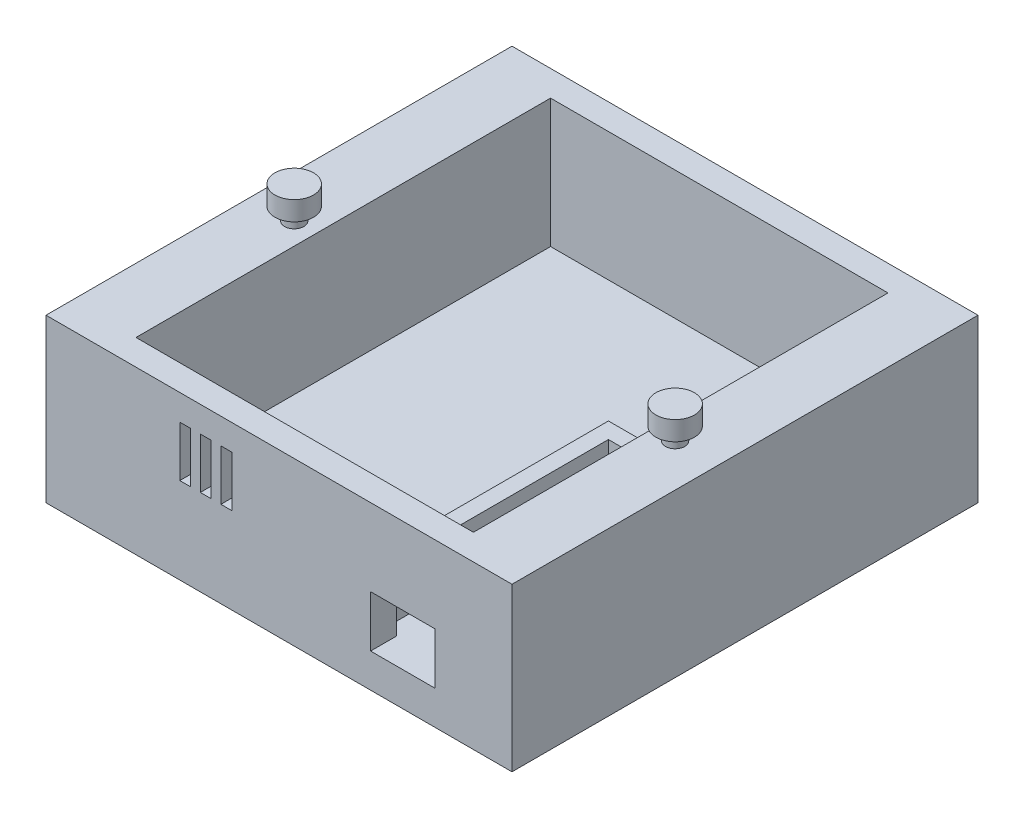
ISO-10303-21;
HEADER;
FILE_DESCRIPTION(('STEP AP214'),'2;1');
FILE_NAME('part.step','',(''),(''),'','','');
FILE_SCHEMA(('AUTOMOTIVE_DESIGN { 1 0 10303 214 1 1 1 1 }'));
ENDSEC;
DATA;
#1=APPLICATION_CONTEXT('core data for automotive mechanical design processes');
#2=APPLICATION_PROTOCOL_DEFINITION('international standard','automotive_design',2000,#1);
#3=PRODUCT_CONTEXT('',#1,'mechanical');
#4=PRODUCT('Part','Part','',(#3));
#5=PRODUCT_RELATED_PRODUCT_CATEGORY('part','',(#4));
#6=PRODUCT_DEFINITION_FORMATION('','',#4);
#7=PRODUCT_DEFINITION_CONTEXT('part definition',#1,'design');
#8=PRODUCT_DEFINITION('design','',#6,#7);
#9=PRODUCT_DEFINITION_SHAPE('','',#8);
#10=(LENGTH_UNIT() NAMED_UNIT(*) SI_UNIT(.MILLI.,.METRE.));
#11=(NAMED_UNIT(*) PLANE_ANGLE_UNIT() SI_UNIT($,.RADIAN.));
#12=(NAMED_UNIT(*) SI_UNIT($,.STERADIAN.) SOLID_ANGLE_UNIT());
#13=UNCERTAINTY_MEASURE_WITH_UNIT(LENGTH_MEASURE(1.E-05),#10,'distance_accuracy_value','');
#14=(GEOMETRIC_REPRESENTATION_CONTEXT(3) GLOBAL_UNCERTAINTY_ASSIGNED_CONTEXT((#13)) GLOBAL_UNIT_ASSIGNED_CONTEXT((#10,
#11,#12)) REPRESENTATION_CONTEXT('',''));
#15=CARTESIAN_POINT('',(0.,0.,0.));
#16=DIRECTION('',(0.,0.,1.));
#17=DIRECTION('',(1.,0.,0.));
#18=AXIS2_PLACEMENT_3D('',#15,#16,#17);
#19=CARTESIAN_POINT('',(79.375,6.7,-5.08));
#20=DIRECTION('',(1.,0.,0.));
#21=DIRECTION('',(0.,0.,-1.));
#22=AXIS2_PLACEMENT_3D('',#19,#20,#21);
#23=PLANE('',#22);
#24=DIRECTION('',(0.,-1.,0.));
#25=VECTOR('',#24,1.);
#26=CARTESIAN_POINT('',(79.375,16.86,-52.705));
#27=LINE('',#26,#25);
#28=CARTESIAN_POINT('',(79.375,16.86,-52.705));
#29=VERTEX_POINT('',#28);
#30=CARTESIAN_POINT('',(79.375,6.7,-52.705));
#31=VERTEX_POINT('',#30);
#32=EDGE_CURVE('E290',#29,#31,#27,.T.);
#33=ORIENTED_EDGE('',*,*,#32,.F.);
#34=DIRECTION('',(0.,0.,-1.));
#35=VECTOR('',#34,1.);
#36=CARTESIAN_POINT('',(79.375,16.86,0.));
#37=LINE('',#36,#35);
#38=CARTESIAN_POINT('',(79.375,16.86,-49.53));
#39=VERTEX_POINT('',#38);
#40=EDGE_CURVE('E288',#39,#29,#37,.T.);
#41=ORIENTED_EDGE('',*,*,#40,.F.);
#42=DIRECTION('',(0.,-1.,0.));
#43=VECTOR('',#42,1.);
#44=CARTESIAN_POINT('',(79.375,16.86,-49.53));
#45=LINE('',#44,#43);
#46=CARTESIAN_POINT('',(79.375,6.7,-49.53));
#47=VERTEX_POINT('',#46);
#48=EDGE_CURVE('E301',#39,#47,#45,.T.);
#49=ORIENTED_EDGE('',*,*,#48,.T.);
#50=DIRECTION('',(0.,0.,-1.));
#51=VECTOR('',#50,1.);
#52=CARTESIAN_POINT('',(79.375,6.7,-5.08));
#53=LINE('',#52,#51);
#54=CARTESIAN_POINT('',(79.375,6.7,-5.08));
#55=VERTEX_POINT('',#54);
#56=EDGE_CURVE('E391',#55,#47,#53,.T.);
#57=ORIENTED_EDGE('',*,*,#56,.F.);
#58=DIRECTION('',(0.,1.,0.));
#59=VECTOR('',#58,1.);
#60=CARTESIAN_POINT('',(79.375,6.7,-5.08));
#61=LINE('',#60,#59);
#62=CARTESIAN_POINT('',(79.375,32.1,-5.08));
#63=VERTEX_POINT('',#62);
#64=EDGE_CURVE('E412',#55,#63,#61,.T.);
#65=ORIENTED_EDGE('',*,*,#64,.T.);
#66=DIRECTION('',(0.,0.,-1.));
#67=VECTOR('',#66,1.);
#68=CARTESIAN_POINT('',(79.375,32.1,-5.08));
#69=LINE('',#68,#67);
#70=CARTESIAN_POINT('',(79.375,32.1,-86.995));
#71=VERTEX_POINT('',#70);
#72=EDGE_CURVE('E402',#63,#71,#69,.T.);
#73=ORIENTED_EDGE('',*,*,#72,.T.);
#74=DIRECTION('',(0.,1.,0.));
#75=VECTOR('',#74,1.);
#76=CARTESIAN_POINT('',(79.375,6.7,-86.995));
#77=LINE('',#76,#75);
#78=CARTESIAN_POINT('',(79.375,6.7,-86.995));
#79=VERTEX_POINT('',#78);
#80=EDGE_CURVE('E410',#79,#71,#77,.T.);
#81=ORIENTED_EDGE('',*,*,#80,.F.);
#82=EDGE_CURVE('E389',#31,#79,#53,.T.);
#83=ORIENTED_EDGE('',*,*,#82,.F.);
#84=EDGE_LOOP('',(#33,#41,#49,#57,#65,#73,#81,#83));
#85=FACE_BOUND('',#84,.T.);
#86=ADVANCED_FACE('F41',(#85),#23,.F.);
#87=CARTESIAN_POINT('',(12.7,6.7,-5.08));
#88=DIRECTION('',(0.,0.,1.));
#89=DIRECTION('',(1.,0.,0.));
#90=AXIS2_PLACEMENT_3D('',#87,#88,#89);
#91=PLANE('',#90);
#92=DIRECTION('',(0.,1.,0.));
#93=VECTOR('',#92,1.);
#94=CARTESIAN_POINT('',(36.703,6.7,-5.08));
#95=LINE('',#94,#93);
#96=CARTESIAN_POINT('',(36.703,17.02,-5.08));
#97=VERTEX_POINT('',#96);
#98=CARTESIAN_POINT('',(36.703,27.02,-5.08));
#99=VERTEX_POINT('',#98);
#100=EDGE_CURVE('E457',#97,#99,#95,.T.);
#101=ORIENTED_EDGE('',*,*,#100,.T.);
#102=DIRECTION('',(-1.,0.,0.));
#103=VECTOR('',#102,1.);
#104=CARTESIAN_POINT('',(12.7,27.02,-5.08));
#105=LINE('',#104,#103);
#106=CARTESIAN_POINT('',(34.5601428571429,27.02,-5.08));
#107=VERTEX_POINT('',#106);
#108=EDGE_CURVE('E460',#99,#107,#105,.T.);
#109=ORIENTED_EDGE('',*,*,#108,.T.);
#110=DIRECTION('',(0.,-1.,0.));
#111=VECTOR('',#110,1.);
#112=CARTESIAN_POINT('',(34.5601428571429,6.7,-5.08));
#113=LINE('',#112,#111);
#114=CARTESIAN_POINT('',(34.5601428571429,17.02,-5.08));
#115=VERTEX_POINT('',#114);
#116=EDGE_CURVE('E451',#107,#115,#113,.T.);
#117=ORIENTED_EDGE('',*,*,#116,.T.);
#118=DIRECTION('',(1.,0.,0.));
#119=VECTOR('',#118,1.);
#120=CARTESIAN_POINT('',(12.7,17.02,-5.08));
#121=LINE('',#120,#119);
#122=EDGE_CURVE('E454',#115,#97,#121,.T.);
#123=ORIENTED_EDGE('',*,*,#122,.T.);
#124=EDGE_LOOP('',(#101,#109,#117,#123));
#125=FACE_BOUND('',#124,.T.);
#126=DIRECTION('',(0.,1.,0.));
#127=VECTOR('',#126,1.);
#128=CARTESIAN_POINT('',(32.639,6.7,-5.08));
#129=LINE('',#128,#127);
#130=CARTESIAN_POINT('',(32.639,17.02,-5.08));
#131=VERTEX_POINT('',#130);
#132=CARTESIAN_POINT('',(32.639,27.02,-5.08));
#133=VERTEX_POINT('',#132);
#134=EDGE_CURVE('E469',#131,#133,#129,.T.);
#135=ORIENTED_EDGE('',*,*,#134,.T.);
#136=DIRECTION('',(-1.,0.,0.));
#137=VECTOR('',#136,1.);
#138=CARTESIAN_POINT('',(12.7,27.02,-5.08));
#139=LINE('',#138,#137);
#140=CARTESIAN_POINT('',(30.4961428571429,27.02,-5.08));
#141=VERTEX_POINT('',#140);
#142=EDGE_CURVE('E472',#133,#141,#139,.T.);
#143=ORIENTED_EDGE('',*,*,#142,.T.);
#144=DIRECTION('',(0.,-1.,0.));
#145=VECTOR('',#144,1.);
#146=CARTESIAN_POINT('',(30.4961428571429,6.7,-5.08));
#147=LINE('',#146,#145);
#148=CARTESIAN_POINT('',(30.4961428571429,17.02,-5.08));
#149=VERTEX_POINT('',#148);
#150=EDGE_CURVE('E463',#141,#149,#147,.T.);
#151=ORIENTED_EDGE('',*,*,#150,.T.);
#152=DIRECTION('',(1.,0.,0.));
#153=VECTOR('',#152,1.);
#154=CARTESIAN_POINT('',(12.7,17.02,-5.08));
#155=LINE('',#154,#153);
#156=EDGE_CURVE('E466',#149,#131,#155,.T.);
#157=ORIENTED_EDGE('',*,*,#156,.T.);
#158=EDGE_LOOP('',(#135,#143,#151,#157));
#159=FACE_BOUND('',#158,.T.);
#160=DIRECTION('',(-1.,0.,0.));
#161=VECTOR('',#160,1.);
#162=CARTESIAN_POINT('',(12.7,27.02,-5.08));
#163=LINE('',#162,#161);
#164=CARTESIAN_POINT('',(28.575,27.02,-5.08));
#165=VERTEX_POINT('',#164);
#166=CARTESIAN_POINT('',(26.4321428571429,27.02,-5.08));
#167=VERTEX_POINT('',#166);
#168=EDGE_CURVE('E49',#165,#167,#163,.T.);
#169=ORIENTED_EDGE('',*,*,#168,.T.);
#170=DIRECTION('',(0.,-1.,0.));
#171=VECTOR('',#170,1.);
#172=CARTESIAN_POINT('',(26.4321428571429,6.7,-5.08));
#173=LINE('',#172,#171);
#174=CARTESIAN_POINT('',(26.4321428571429,17.02,-5.08));
#175=VERTEX_POINT('',#174);
#176=EDGE_CURVE('E11',#167,#175,#173,.T.);
#177=ORIENTED_EDGE('',*,*,#176,.T.);
#178=DIRECTION('',(1.,0.,0.));
#179=VECTOR('',#178,1.);
#180=CARTESIAN_POINT('',(12.7,17.02,-5.08));
#181=LINE('',#180,#179);
#182=CARTESIAN_POINT('',(28.575,17.02,-5.08));
#183=VERTEX_POINT('',#182);
#184=EDGE_CURVE('E475',#175,#183,#181,.T.);
#185=ORIENTED_EDGE('',*,*,#184,.T.);
#186=DIRECTION('',(0.,1.,0.));
#187=VECTOR('',#186,1.);
#188=CARTESIAN_POINT('',(28.575,6.7,-5.08));
#189=LINE('',#188,#187);
#190=EDGE_CURVE('E478',#183,#165,#189,.T.);
#191=ORIENTED_EDGE('',*,*,#190,.T.);
#192=EDGE_LOOP('',(#169,#177,#185,#191));
#193=FACE_BOUND('',#192,.T.);
#194=DIRECTION('',(-1.,0.,0.));
#195=VECTOR('',#194,1.);
#196=CARTESIAN_POINT('',(12.7,16.86,-5.08));
#197=LINE('',#196,#195);
#198=CARTESIAN_POINT('',(76.835,16.86,-5.08));
#199=VERTEX_POINT('',#198);
#200=CARTESIAN_POINT('',(64.135,16.86,-5.08));
#201=VERTEX_POINT('',#200);
#202=EDGE_CURVE('E270',#199,#201,#197,.T.);
#203=ORIENTED_EDGE('',*,*,#202,.T.);
#204=DIRECTION('',(0.,-1.,0.));
#205=VECTOR('',#204,1.);
#206=CARTESIAN_POINT('',(64.135,6.7,-5.08));
#207=LINE('',#206,#205);
#208=CARTESIAN_POINT('',(64.135,6.7,-5.08));
#209=VERTEX_POINT('',#208);
#210=EDGE_CURVE('E267',#201,#209,#207,.T.);
#211=ORIENTED_EDGE('',*,*,#210,.T.);
#212=DIRECTION('',(1.,0.,0.));
#213=VECTOR('',#212,1.);
#214=CARTESIAN_POINT('',(12.7,6.7,-5.08));
#215=LINE('',#214,#213);
#216=CARTESIAN_POINT('',(61.595,6.7,-5.08));
#217=VERTEX_POINT('',#216);
#218=EDGE_CURVE('E390',#217,#209,#215,.T.);
#219=ORIENTED_EDGE('',*,*,#218,.F.);
#220=DIRECTION('',(0.,-1.,0.));
#221=VECTOR('',#220,1.);
#222=CARTESIAN_POINT('',(61.595,16.86,-5.08));
#223=LINE('',#222,#221);
#224=CARTESIAN_POINT('',(61.595,16.86,-5.08));
#225=VERTEX_POINT('',#224);
#226=EDGE_CURVE('E307',#225,#217,#223,.T.);
#227=ORIENTED_EDGE('',*,*,#226,.F.);
#228=DIRECTION('',(1.,0.,0.));
#229=VECTOR('',#228,1.);
#230=CARTESIAN_POINT('',(0.,16.86,-5.08));
#231=LINE('',#230,#229);
#232=CARTESIAN_POINT('',(58.42,16.86,-5.08));
#233=VERTEX_POINT('',#232);
#234=EDGE_CURVE('E280',#233,#225,#231,.T.);
#235=ORIENTED_EDGE('',*,*,#234,.F.);
#236=DIRECTION('',(0.,-1.,0.));
#237=VECTOR('',#236,1.);
#238=CARTESIAN_POINT('',(58.42,16.86,-5.08));
#239=LINE('',#238,#237);
#240=CARTESIAN_POINT('',(58.42,6.7,-5.08));
#241=VERTEX_POINT('',#240);
#242=EDGE_CURVE('E309',#233,#241,#239,.T.);
#243=ORIENTED_EDGE('',*,*,#242,.T.);
#244=CARTESIAN_POINT('',(12.7,6.7,-5.08));
#245=VERTEX_POINT('',#244);
#246=EDGE_CURVE('E386',#245,#241,#215,.T.);
#247=ORIENTED_EDGE('',*,*,#246,.F.);
#248=DIRECTION('',(0.,1.,0.));
#249=VECTOR('',#248,1.);
#250=CARTESIAN_POINT('',(12.7,6.7,-5.08));
#251=LINE('',#250,#249);
#252=CARTESIAN_POINT('',(12.7,32.1,-5.08));
#253=VERTEX_POINT('',#252);
#254=EDGE_CURVE('E397',#245,#253,#251,.T.);
#255=ORIENTED_EDGE('',*,*,#254,.T.);
#256=DIRECTION('',(1.,0.,0.));
#257=VECTOR('',#256,1.);
#258=CARTESIAN_POINT('',(12.7,32.1,-5.08));
#259=LINE('',#258,#257);
#260=EDGE_CURVE('E399',#253,#63,#259,.T.);
#261=ORIENTED_EDGE('',*,*,#260,.T.);
#262=ORIENTED_EDGE('',*,*,#64,.F.);
#263=CARTESIAN_POINT('',(76.835,6.7,-5.08));
#264=VERTEX_POINT('',#263);
#265=EDGE_CURVE('E384',#264,#55,#215,.T.);
#266=ORIENTED_EDGE('',*,*,#265,.F.);
#267=DIRECTION('',(0.,1.,0.));
#268=VECTOR('',#267,1.);
#269=CARTESIAN_POINT('',(76.835,6.7,-5.08));
#270=LINE('',#269,#268);
#271=EDGE_CURVE('E243',#264,#199,#270,.T.);
#272=ORIENTED_EDGE('',*,*,#271,.T.);
#273=EDGE_LOOP('',(#203,#211,#219,#227,#235,#243,#247,#255,#261,#262,#266,#272));
#274=FACE_BOUND('',#273,.T.);
#275=ADVANCED_FACE('F482',(#125,#159,#193,#274),#91,.F.);
#276=CARTESIAN_POINT('',(0.,6.7,0.));
#277=DIRECTION('',(0.,-1.,0.));
#278=DIRECTION('',(0.,0.,-1.));
#279=AXIS2_PLACEMENT_3D('',#276,#277,#278);
#280=PLANE('',#279);
#281=DIRECTION('',(-1.,0.,0.));
#282=VECTOR('',#281,1.);
#283=CARTESIAN_POINT('',(0.,6.7,-52.705));
#284=LINE('',#283,#282);
#285=CARTESIAN_POINT('',(58.42,6.7,-52.705));
#286=VERTEX_POINT('',#285);
#287=EDGE_CURVE('E273',#31,#286,#284,.T.);
#288=ORIENTED_EDGE('',*,*,#287,.F.);
#289=ORIENTED_EDGE('',*,*,#82,.T.);
#290=DIRECTION('',(-1.,0.,0.));
#291=VECTOR('',#290,1.);
#292=CARTESIAN_POINT('',(12.7,6.7,-86.995));
#293=LINE('',#292,#291);
#294=CARTESIAN_POINT('',(12.7,6.7,-86.995));
#295=VERTEX_POINT('',#294);
#296=EDGE_CURVE('E394',#79,#295,#293,.T.);
#297=ORIENTED_EDGE('',*,*,#296,.T.);
#298=DIRECTION('',(0.,0.,1.));
#299=VECTOR('',#298,1.);
#300=CARTESIAN_POINT('',(12.7,6.7,-5.08));
#301=LINE('',#300,#299);
#302=EDGE_CURVE('E381',#295,#245,#301,.T.);
#303=ORIENTED_EDGE('',*,*,#302,.T.);
#304=ORIENTED_EDGE('',*,*,#246,.T.);
#305=DIRECTION('',(0.,0.,1.));
#306=VECTOR('',#305,1.);
#307=CARTESIAN_POINT('',(58.42,6.7,0.));
#308=LINE('',#307,#306);
#309=EDGE_CURVE('E293',#286,#241,#308,.T.);
#310=ORIENTED_EDGE('',*,*,#309,.F.);
#311=EDGE_LOOP('',(#288,#289,#297,#303,#304,#310));
#312=FACE_BOUND('',#311,.T.);
#313=ADVANCED_FACE('F519',(#312),#280,.F.);
#314=CARTESIAN_POINT('',(0.,32.1,0.));
#315=DIRECTION('',(-1.,0.,0.));
#316=DIRECTION('',(0.,0.,1.));
#317=AXIS2_PLACEMENT_3D('',#314,#315,#316);
#318=PLANE('',#317);
#319=DIRECTION('',(0.,0.,-1.));
#320=VECTOR('',#319,1.);
#321=CARTESIAN_POINT('',(0.,0.,0.));
#322=LINE('',#321,#320);
#323=CARTESIAN_POINT('',(0.,0.,0.));
#324=VERTEX_POINT('',#323);
#325=CARTESIAN_POINT('',(0.,0.,-92.075));
#326=VERTEX_POINT('',#325);
#327=EDGE_CURVE('E409',#324,#326,#322,.T.);
#328=ORIENTED_EDGE('',*,*,#327,.F.);
#329=DIRECTION('',(0.,-1.,0.));
#330=VECTOR('',#329,1.);
#331=CARTESIAN_POINT('',(0.,32.1,0.));
#332=LINE('',#331,#330);
#333=CARTESIAN_POINT('',(0.,32.1,0.));
#334=VERTEX_POINT('',#333);
#335=EDGE_CURVE('E437',#334,#324,#332,.T.);
#336=ORIENTED_EDGE('',*,*,#335,.F.);
#337=DIRECTION('',(0.,0.,-1.));
#338=VECTOR('',#337,1.);
#339=CARTESIAN_POINT('',(0.,32.1,0.));
#340=LINE('',#339,#338);
#341=CARTESIAN_POINT('',(0.,32.1,-92.075));
#342=VERTEX_POINT('',#341);
#343=EDGE_CURVE('E416',#334,#342,#340,.T.);
#344=ORIENTED_EDGE('',*,*,#343,.T.);
#345=DIRECTION('',(0.,-1.,0.));
#346=VECTOR('',#345,1.);
#347=CARTESIAN_POINT('',(0.,32.1,-92.075));
#348=LINE('',#347,#346);
#349=EDGE_CURVE('E427',#342,#326,#348,.T.);
#350=ORIENTED_EDGE('',*,*,#349,.T.);
#351=EDGE_LOOP('',(#328,#336,#344,#350));
#352=FACE_BOUND('',#351,.T.);
#353=ADVANCED_FACE('F43',(#352),#318,.T.);
#354=CARTESIAN_POINT('',(0.,32.1,0.));
#355=DIRECTION('',(0.,0.,-1.));
#356=DIRECTION('',(-1.,0.,0.));
#357=AXIS2_PLACEMENT_3D('',#354,#355,#356);
#358=PLANE('',#357);
#359=DIRECTION('',(1.,0.,0.));
#360=VECTOR('',#359,1.);
#361=CARTESIAN_POINT('',(64.135,6.7,0.));
#362=LINE('',#361,#360);
#363=CARTESIAN_POINT('',(64.135,6.7,0.));
#364=VERTEX_POINT('',#363);
#365=CARTESIAN_POINT('',(76.835,6.7,0.));
#366=VERTEX_POINT('',#365);
#367=EDGE_CURVE('E249',#364,#366,#362,.T.);
#368=ORIENTED_EDGE('',*,*,#367,.F.);
#369=DIRECTION('',(0.,-1.,0.));
#370=VECTOR('',#369,1.);
#371=CARTESIAN_POINT('',(64.135,6.7,0.));
#372=LINE('',#371,#370);
#373=CARTESIAN_POINT('',(64.135,16.86,0.));
#374=VERTEX_POINT('',#373);
#375=EDGE_CURVE('E56',#374,#364,#372,.T.);
#376=ORIENTED_EDGE('',*,*,#375,.F.);
#377=DIRECTION('',(-1.,0.,0.));
#378=VECTOR('',#377,1.);
#379=CARTESIAN_POINT('',(64.135,16.86,0.));
#380=LINE('',#379,#378);
#381=CARTESIAN_POINT('',(76.835,16.86,0.));
#382=VERTEX_POINT('',#381);
#383=EDGE_CURVE('E257',#382,#374,#380,.T.);
#384=ORIENTED_EDGE('',*,*,#383,.F.);
#385=DIRECTION('',(0.,1.,0.));
#386=VECTOR('',#385,1.);
#387=CARTESIAN_POINT('',(76.835,6.7,0.));
#388=LINE('',#387,#386);
#389=EDGE_CURVE('E240',#366,#382,#388,.T.);
#390=ORIENTED_EDGE('',*,*,#389,.F.);
#391=EDGE_LOOP('',(#368,#376,#384,#390));
#392=FACE_BOUND('',#391,.T.);
#393=DIRECTION('',(1.,0.,0.));
#394=VECTOR('',#393,1.);
#395=CARTESIAN_POINT('',(26.4321428571429,17.02,0.));
#396=LINE('',#395,#394);
#397=CARTESIAN_POINT('',(26.4321428571429,17.02,0.));
#398=VERTEX_POINT('',#397);
#399=CARTESIAN_POINT('',(28.575,17.02,0.));
#400=VERTEX_POINT('',#399);
#401=EDGE_CURVE('E317',#398,#400,#396,.T.);
#402=ORIENTED_EDGE('',*,*,#401,.F.);
#403=DIRECTION('',(0.,-1.,0.));
#404=VECTOR('',#403,1.);
#405=CARTESIAN_POINT('',(26.4321428571429,27.02,0.));
#406=LINE('',#405,#404);
#407=CARTESIAN_POINT('',(26.4321428571429,27.02,0.));
#408=VERTEX_POINT('',#407);
#409=EDGE_CURVE('E315',#408,#398,#406,.T.);
#410=ORIENTED_EDGE('',*,*,#409,.F.);
#411=DIRECTION('',(-1.,0.,0.));
#412=VECTOR('',#411,1.);
#413=CARTESIAN_POINT('',(26.4321428571429,27.02,0.));
#414=LINE('',#413,#412);
#415=CARTESIAN_POINT('',(28.575,27.02,0.));
#416=VERTEX_POINT('',#415);
#417=EDGE_CURVE('E324',#416,#408,#414,.T.);
#418=ORIENTED_EDGE('',*,*,#417,.F.);
#419=DIRECTION('',(0.,1.,0.));
#420=VECTOR('',#419,1.);
#421=CARTESIAN_POINT('',(28.575,27.02,0.));
#422=LINE('',#421,#420);
#423=EDGE_CURVE('E321',#400,#416,#422,.T.);
#424=ORIENTED_EDGE('',*,*,#423,.F.);
#425=EDGE_LOOP('',(#402,#410,#418,#424));
#426=FACE_BOUND('',#425,.T.);
#427=DIRECTION('',(0.,-1.,0.));
#428=VECTOR('',#427,1.);
#429=CARTESIAN_POINT('',(30.4961428571429,27.02,0.));
#430=LINE('',#429,#428);
#431=CARTESIAN_POINT('',(30.4961428571429,27.02,0.));
#432=VERTEX_POINT('',#431);
#433=CARTESIAN_POINT('',(30.4961428571429,17.02,0.));
#434=VERTEX_POINT('',#433);
#435=EDGE_CURVE('E339',#432,#434,#430,.T.);
#436=ORIENTED_EDGE('',*,*,#435,.F.);
#437=DIRECTION('',(-1.,0.,0.));
#438=VECTOR('',#437,1.);
#439=CARTESIAN_POINT('',(30.4961428571429,27.02,0.));
#440=LINE('',#439,#438);
#441=CARTESIAN_POINT('',(32.639,27.02,0.));
#442=VERTEX_POINT('',#441);
#443=EDGE_CURVE('E337',#442,#432,#440,.T.);
#444=ORIENTED_EDGE('',*,*,#443,.F.);
#445=DIRECTION('',(0.,1.,0.));
#446=VECTOR('',#445,1.);
#447=CARTESIAN_POINT('',(32.639,27.02,0.));
#448=LINE('',#447,#446);
#449=CARTESIAN_POINT('',(32.639,17.02,0.));
#450=VERTEX_POINT('',#449);
#451=EDGE_CURVE('E346',#450,#442,#448,.T.);
#452=ORIENTED_EDGE('',*,*,#451,.F.);
#453=DIRECTION('',(1.,0.,0.));
#454=VECTOR('',#453,1.);
#455=CARTESIAN_POINT('',(30.4961428571429,17.02,0.));
#456=LINE('',#455,#454);
#457=EDGE_CURVE('E343',#434,#450,#456,.T.);
#458=ORIENTED_EDGE('',*,*,#457,.F.);
#459=EDGE_LOOP('',(#436,#444,#452,#458));
#460=FACE_BOUND('',#459,.T.);
#461=DIRECTION('',(0.,-1.,0.));
#462=VECTOR('',#461,1.);
#463=CARTESIAN_POINT('',(34.5601428571429,27.02,0.));
#464=LINE('',#463,#462);
#465=CARTESIAN_POINT('',(34.5601428571429,27.02,0.));
#466=VERTEX_POINT('',#465);
#467=CARTESIAN_POINT('',(34.5601428571429,17.02,0.));
#468=VERTEX_POINT('',#467);
#469=EDGE_CURVE('E358',#466,#468,#464,.T.);
#470=ORIENTED_EDGE('',*,*,#469,.F.);
#471=DIRECTION('',(-1.,0.,0.));
#472=VECTOR('',#471,1.);
#473=CARTESIAN_POINT('',(34.5601428571429,27.02,0.));
#474=LINE('',#473,#472);
#475=CARTESIAN_POINT('',(36.703,27.02,0.));
#476=VERTEX_POINT('',#475);
#477=EDGE_CURVE('E314',#476,#466,#474,.T.);
#478=ORIENTED_EDGE('',*,*,#477,.F.);
#479=DIRECTION('',(0.,1.,0.));
#480=VECTOR('',#479,1.);
#481=CARTESIAN_POINT('',(36.703,27.02,0.));
#482=LINE('',#481,#480);
#483=CARTESIAN_POINT('',(36.703,17.02,0.));
#484=VERTEX_POINT('',#483);
#485=EDGE_CURVE('E364',#484,#476,#482,.T.);
#486=ORIENTED_EDGE('',*,*,#485,.F.);
#487=DIRECTION('',(1.,0.,0.));
#488=VECTOR('',#487,1.);
#489=CARTESIAN_POINT('',(34.5601428571429,17.02,0.));
#490=LINE('',#489,#488);
#491=EDGE_CURVE('E361',#468,#484,#490,.T.);
#492=ORIENTED_EDGE('',*,*,#491,.F.);
#493=EDGE_LOOP('',(#470,#478,#486,#492));
#494=FACE_BOUND('',#493,.T.);
#495=DIRECTION('',(1.,0.,0.));
#496=VECTOR('',#495,1.);
#497=CARTESIAN_POINT('',(0.,0.,0.));
#498=LINE('',#497,#496);
#499=CARTESIAN_POINT('',(92.075,0.,0.));
#500=VERTEX_POINT('',#499);
#501=EDGE_CURVE('E420',#324,#500,#498,.T.);
#502=ORIENTED_EDGE('',*,*,#501,.T.);
#503=DIRECTION('',(0.,-1.,0.));
#504=VECTOR('',#503,1.);
#505=CARTESIAN_POINT('',(92.075,32.1,0.));
#506=LINE('',#505,#504);
#507=CARTESIAN_POINT('',(92.075,32.1,0.));
#508=VERTEX_POINT('',#507);
#509=EDGE_CURVE('E440',#508,#500,#506,.T.);
#510=ORIENTED_EDGE('',*,*,#509,.F.);
#511=DIRECTION('',(1.,0.,0.));
#512=VECTOR('',#511,1.);
#513=CARTESIAN_POINT('',(0.,32.1,0.));
#514=LINE('',#513,#512);
#515=EDGE_CURVE('E425',#334,#508,#514,.T.);
#516=ORIENTED_EDGE('',*,*,#515,.F.);
#517=ORIENTED_EDGE('',*,*,#335,.T.);
#518=EDGE_LOOP('',(#502,#510,#516,#517));
#519=FACE_BOUND('',#518,.T.);
#520=ADVANCED_FACE('F254',(#392,#426,#460,#494,#519),#358,.F.);
#521=CARTESIAN_POINT('',(92.075,32.1,0.));
#522=DIRECTION('',(-1.,0.,0.));
#523=DIRECTION('',(0.,0.,1.));
#524=AXIS2_PLACEMENT_3D('',#521,#522,#523);
#525=PLANE('',#524);
#526=DIRECTION('',(0.,0.,-1.));
#527=VECTOR('',#526,1.);
#528=CARTESIAN_POINT('',(92.075,0.,0.));
#529=LINE('',#528,#527);
#530=CARTESIAN_POINT('',(92.075,0.,-92.075));
#531=VERTEX_POINT('',#530);
#532=EDGE_CURVE('E433',#500,#531,#529,.T.);
#533=ORIENTED_EDGE('',*,*,#532,.T.);
#534=DIRECTION('',(0.,-1.,0.));
#535=VECTOR('',#534,1.);
#536=CARTESIAN_POINT('',(92.075,32.1,-92.075));
#537=LINE('',#536,#535);
#538=CARTESIAN_POINT('',(92.075,32.1,-92.075));
#539=VERTEX_POINT('',#538);
#540=EDGE_CURVE('E443',#539,#531,#537,.T.);
#541=ORIENTED_EDGE('',*,*,#540,.F.);
#542=DIRECTION('',(0.,0.,-1.));
#543=VECTOR('',#542,1.);
#544=CARTESIAN_POINT('',(92.075,32.1,0.));
#545=LINE('',#544,#543);
#546=EDGE_CURVE('E423',#508,#539,#545,.T.);
#547=ORIENTED_EDGE('',*,*,#546,.F.);
#548=ORIENTED_EDGE('',*,*,#509,.T.);
#549=EDGE_LOOP('',(#533,#541,#547,#548));
#550=FACE_BOUND('',#549,.T.);
#551=ADVANCED_FACE('F542',(#550),#525,.F.);
#552=CARTESIAN_POINT('',(0.,32.1,-92.075));
#553=DIRECTION('',(0.,0.,-1.));
#554=DIRECTION('',(-1.,0.,0.));
#555=AXIS2_PLACEMENT_3D('',#552,#553,#554);
#556=PLANE('',#555);
#557=DIRECTION('',(1.,0.,0.));
#558=VECTOR('',#557,1.);
#559=CARTESIAN_POINT('',(0.,0.,-92.075));
#560=LINE('',#559,#558);
#561=EDGE_CURVE('E430',#326,#531,#560,.T.);
#562=ORIENTED_EDGE('',*,*,#561,.F.);
#563=ORIENTED_EDGE('',*,*,#349,.F.);
#564=DIRECTION('',(1.,0.,0.));
#565=VECTOR('',#564,1.);
#566=CARTESIAN_POINT('',(0.,32.1,-92.075));
#567=LINE('',#566,#565);
#568=EDGE_CURVE('E419',#342,#539,#567,.T.);
#569=ORIENTED_EDGE('',*,*,#568,.T.);
#570=ORIENTED_EDGE('',*,*,#540,.T.);
#571=EDGE_LOOP('',(#562,#563,#569,#570));
#572=FACE_BOUND('',#571,.T.);
#573=ADVANCED_FACE('F535',(#572),#556,.T.);
#574=CARTESIAN_POINT('',(0.,32.1,0.));
#575=DIRECTION('',(0.,-1.,0.));
#576=DIRECTION('',(0.,0.,-1.));
#577=AXIS2_PLACEMENT_3D('',#574,#575,#576);
#578=PLANE('',#577);
#579=CARTESIAN_POINT('',(83.67,32.1,-40.64));
#580=DIRECTION('',(0.,-1.,0.));
#581=DIRECTION('',(0.,0.,-1.));
#582=AXIS2_PLACEMENT_3D('',#579,#580,#581);
#583=CIRCLE('',#582,1.90500000000001);
#584=CARTESIAN_POINT('',(83.67,32.1,-42.545));
#585=VERTEX_POINT('',#584);
#586=EDGE_CURVE('E448',#585,#585,#583,.F.);
#587=ORIENTED_EDGE('',*,*,#586,.F.);
#588=EDGE_LOOP('',(#587));
#589=FACE_BOUND('',#588,.T.);
#590=CARTESIAN_POINT('',(8.405,32.1,-40.64));
#591=DIRECTION('',(0.,-1.,0.));
#592=DIRECTION('',(0.,0.,-1.));
#593=AXIS2_PLACEMENT_3D('',#590,#591,#592);
#594=CIRCLE('',#593,1.905);
#595=CARTESIAN_POINT('',(8.405,32.1,-42.545));
#596=VERTEX_POINT('',#595);
#597=EDGE_CURVE('E439',#596,#596,#594,.F.);
#598=ORIENTED_EDGE('',*,*,#597,.F.);
#599=EDGE_LOOP('',(#598));
#600=FACE_BOUND('',#599,.T.);
#601=ORIENTED_EDGE('',*,*,#260,.F.);
#602=DIRECTION('',(0.,0.,1.));
#603=VECTOR('',#602,1.);
#604=CARTESIAN_POINT('',(12.7,32.1,-5.08));
#605=LINE('',#604,#603);
#606=CARTESIAN_POINT('',(12.7,32.1,-86.995));
#607=VERTEX_POINT('',#606);
#608=EDGE_CURVE('E380',#607,#253,#605,.T.);
#609=ORIENTED_EDGE('',*,*,#608,.F.);
#610=DIRECTION('',(-1.,0.,0.));
#611=VECTOR('',#610,1.);
#612=CARTESIAN_POINT('',(12.7,32.1,-86.995));
#613=LINE('',#612,#611);
#614=EDGE_CURVE('E385',#71,#607,#613,.T.);
#615=ORIENTED_EDGE('',*,*,#614,.F.);
#616=ORIENTED_EDGE('',*,*,#72,.F.);
#617=EDGE_LOOP('',(#601,#609,#615,#616));
#618=FACE_BOUND('',#617,.T.);
#619=ORIENTED_EDGE('',*,*,#343,.F.);
#620=ORIENTED_EDGE('',*,*,#515,.T.);
#621=ORIENTED_EDGE('',*,*,#546,.T.);
#622=ORIENTED_EDGE('',*,*,#568,.F.);
#623=EDGE_LOOP('',(#619,#620,#621,#622));
#624=FACE_BOUND('',#623,.T.);
#625=ADVANCED_FACE('F532',(#589,#600,#618,#624),#578,.F.);
#626=CARTESIAN_POINT('',(0.,0.,0.));
#627=DIRECTION('',(0.,-1.,0.));
#628=DIRECTION('',(0.,0.,-1.));
#629=AXIS2_PLACEMENT_3D('',#626,#627,#628);
#630=PLANE('',#629);
#631=ORIENTED_EDGE('',*,*,#327,.T.);
#632=ORIENTED_EDGE('',*,*,#561,.T.);
#633=ORIENTED_EDGE('',*,*,#532,.F.);
#634=ORIENTED_EDGE('',*,*,#501,.F.);
#635=EDGE_LOOP('',(#631,#632,#633,#634));
#636=FACE_BOUND('',#635,.T.);
#637=ADVANCED_FACE('F530',(#636),#630,.T.);
#638=CARTESIAN_POINT('',(12.7,6.7,-5.08));
#639=DIRECTION('',(-1.,0.,0.));
#640=DIRECTION('',(0.,0.,1.));
#641=AXIS2_PLACEMENT_3D('',#638,#639,#640);
#642=PLANE('',#641);
#643=ORIENTED_EDGE('',*,*,#608,.T.);
#644=ORIENTED_EDGE('',*,*,#254,.F.);
#645=ORIENTED_EDGE('',*,*,#302,.F.);
#646=DIRECTION('',(0.,1.,0.));
#647=VECTOR('',#646,1.);
#648=CARTESIAN_POINT('',(12.7,6.7,-86.995));
#649=LINE('',#648,#647);
#650=EDGE_CURVE('E407',#295,#607,#649,.T.);
#651=ORIENTED_EDGE('',*,*,#650,.T.);
#652=EDGE_LOOP('',(#643,#644,#645,#651));
#653=FACE_BOUND('',#652,.T.);
#654=ADVANCED_FACE('F527',(#653),#642,.F.);
#655=CARTESIAN_POINT('',(12.7,6.7,-86.995));
#656=DIRECTION('',(0.,0.,-1.));
#657=DIRECTION('',(-1.,0.,0.));
#658=AXIS2_PLACEMENT_3D('',#655,#656,#657);
#659=PLANE('',#658);
#660=ORIENTED_EDGE('',*,*,#614,.T.);
#661=ORIENTED_EDGE('',*,*,#650,.F.);
#662=ORIENTED_EDGE('',*,*,#296,.F.);
#663=ORIENTED_EDGE('',*,*,#80,.T.);
#664=EDGE_LOOP('',(#660,#661,#662,#663));
#665=FACE_BOUND('',#664,.T.);
#666=ADVANCED_FACE('F524',(#665),#659,.F.);
#667=ORIENTED_EDGE('',*,*,#218,.T.);
#668=DIRECTION('',(0.,0.,1.));
#669=VECTOR('',#668,1.);
#670=CARTESIAN_POINT('',(64.135,6.7,-7.62));
#671=LINE('',#670,#669);
#672=EDGE_CURVE('E246',#209,#364,#671,.T.);
#673=ORIENTED_EDGE('',*,*,#672,.T.);
#674=ORIENTED_EDGE('',*,*,#367,.T.);
#675=DIRECTION('',(0.,0.,1.));
#676=VECTOR('',#675,1.);
#677=CARTESIAN_POINT('',(76.835,6.7,-7.62));
#678=LINE('',#677,#676);
#679=EDGE_CURVE('E64',#264,#366,#678,.T.);
#680=ORIENTED_EDGE('',*,*,#679,.F.);
#681=ORIENTED_EDGE('',*,*,#265,.T.);
#682=ORIENTED_EDGE('',*,*,#56,.T.);
#683=DIRECTION('',(-1.,0.,0.));
#684=VECTOR('',#683,1.);
#685=CARTESIAN_POINT('',(0.,6.7,-49.53));
#686=LINE('',#685,#684);
#687=CARTESIAN_POINT('',(61.595,6.7,-49.53));
#688=VERTEX_POINT('',#687);
#689=EDGE_CURVE('E278',#47,#688,#686,.T.);
#690=ORIENTED_EDGE('',*,*,#689,.T.);
#691=DIRECTION('',(0.,0.,1.));
#692=VECTOR('',#691,1.);
#693=CARTESIAN_POINT('',(61.595,6.7,0.));
#694=LINE('',#693,#692);
#695=EDGE_CURVE('E295',#688,#217,#694,.T.);
#696=ORIENTED_EDGE('',*,*,#695,.T.);
#697=EDGE_LOOP('',(#667,#673,#674,#680,#681,#682,#690,#696));
#698=FACE_BOUND('',#697,.T.);
#699=ADVANCED_FACE('F251',(#698),#280,.F.);
#700=CARTESIAN_POINT('',(8.405,34.64,-40.64));
#701=DIRECTION('',(0.,-1.,0.));
#702=DIRECTION('',(0.,0.,-1.));
#703=AXIS2_PLACEMENT_3D('',#700,#701,#702);
#704=CYLINDRICAL_SURFACE('',#703,1.905);
#705=CARTESIAN_POINT('',(8.405,34.64,-40.64));
#706=DIRECTION('',(0.,1.,0.));
#707=DIRECTION('',(0.,0.,1.));
#708=AXIS2_PLACEMENT_3D('',#705,#706,#707);
#709=CIRCLE('',#708,1.905);
#710=CARTESIAN_POINT('',(8.405,34.64,-38.735));
#711=VERTEX_POINT('',#710);
#712=EDGE_CURVE('E377',#711,#711,#709,.T.);
#713=ORIENTED_EDGE('',*,*,#712,.F.);
#714=EDGE_LOOP('',(#713));
#715=FACE_BOUND('',#714,.T.);
#716=ORIENTED_EDGE('',*,*,#597,.T.);
#717=EDGE_LOOP('',(#716));
#718=FACE_BOUND('',#717,.T.);
#719=ADVANCED_FACE('F572',(#715,#718),#704,.T.);
#720=CARTESIAN_POINT('',(83.67,34.64,-40.64));
#721=DIRECTION('',(0.,-1.,0.));
#722=DIRECTION('',(0.,0.,-1.));
#723=AXIS2_PLACEMENT_3D('',#720,#721,#722);
#724=CYLINDRICAL_SURFACE('',#723,1.90500000000001);
#725=CARTESIAN_POINT('',(83.67,34.64,-40.64));
#726=DIRECTION('',(0.,1.,0.));
#727=DIRECTION('',(0.,0.,1.));
#728=AXIS2_PLACEMENT_3D('',#725,#726,#727);
#729=CIRCLE('',#728,1.90500000000001);
#730=CARTESIAN_POINT('',(83.67,34.64,-38.735));
#731=VERTEX_POINT('',#730);
#732=EDGE_CURVE('E330',#731,#731,#729,.T.);
#733=ORIENTED_EDGE('',*,*,#732,.F.);
#734=EDGE_LOOP('',(#733));
#735=FACE_BOUND('',#734,.T.);
#736=ORIENTED_EDGE('',*,*,#586,.T.);
#737=EDGE_LOOP('',(#736));
#738=FACE_BOUND('',#737,.T.);
#739=ADVANCED_FACE('F577',(#735,#738),#724,.T.);
#740=CARTESIAN_POINT('',(34.5601428571429,27.02,-7.));
#741=DIRECTION('',(0.,1.,0.));
#742=DIRECTION('',(0.,0.,1.));
#743=AXIS2_PLACEMENT_3D('',#740,#741,#742);
#744=PLANE('',#743);
#745=DIRECTION('',(0.,0.,1.));
#746=VECTOR('',#745,1.);
#747=CARTESIAN_POINT('',(36.703,27.02,-7.));
#748=LINE('',#747,#746);
#749=EDGE_CURVE('E340',#99,#476,#748,.T.);
#750=ORIENTED_EDGE('',*,*,#749,.T.);
#751=ORIENTED_EDGE('',*,*,#477,.T.);
#752=DIRECTION('',(0.,0.,1.));
#753=VECTOR('',#752,1.);
#754=CARTESIAN_POINT('',(34.5601428571429,27.02,-7.));
#755=LINE('',#754,#753);
#756=EDGE_CURVE('E367',#107,#466,#755,.T.);
#757=ORIENTED_EDGE('',*,*,#756,.F.);
#758=ORIENTED_EDGE('',*,*,#108,.F.);
#759=EDGE_LOOP('',(#750,#751,#757,#758));
#760=FACE_BOUND('',#759,.T.);
#761=ADVANCED_FACE('F695',(#760),#744,.F.);
#762=CARTESIAN_POINT('',(36.703,27.02,-7.));
#763=DIRECTION('',(1.,0.,0.));
#764=DIRECTION('',(0.,0.,-1.));
#765=AXIS2_PLACEMENT_3D('',#762,#763,#764);
#766=PLANE('',#765);
#767=DIRECTION('',(0.,0.,1.));
#768=VECTOR('',#767,1.);
#769=CARTESIAN_POINT('',(36.703,17.02,-7.));
#770=LINE('',#769,#768);
#771=EDGE_CURVE('E369',#97,#484,#770,.T.);
#772=ORIENTED_EDGE('',*,*,#771,.T.);
#773=ORIENTED_EDGE('',*,*,#485,.T.);
#774=ORIENTED_EDGE('',*,*,#749,.F.);
#775=ORIENTED_EDGE('',*,*,#100,.F.);
#776=EDGE_LOOP('',(#772,#773,#774,#775));
#777=FACE_BOUND('',#776,.T.);
#778=ADVANCED_FACE('F691',(#777),#766,.F.);
#779=CARTESIAN_POINT('',(34.5601428571429,17.02,-7.));
#780=DIRECTION('',(0.,-1.,0.));
#781=DIRECTION('',(0.,0.,-1.));
#782=AXIS2_PLACEMENT_3D('',#779,#780,#781);
#783=PLANE('',#782);
#784=DIRECTION('',(0.,0.,1.));
#785=VECTOR('',#784,1.);
#786=CARTESIAN_POINT('',(34.5601428571429,17.02,-7.));
#787=LINE('',#786,#785);
#788=EDGE_CURVE('E371',#115,#468,#787,.T.);
#789=ORIENTED_EDGE('',*,*,#788,.T.);
#790=ORIENTED_EDGE('',*,*,#491,.T.);
#791=ORIENTED_EDGE('',*,*,#771,.F.);
#792=ORIENTED_EDGE('',*,*,#122,.F.);
#793=EDGE_LOOP('',(#789,#790,#791,#792));
#794=FACE_BOUND('',#793,.T.);
#795=ADVANCED_FACE('F694',(#794),#783,.F.);
#796=CARTESIAN_POINT('',(34.5601428571429,27.02,-7.));
#797=DIRECTION('',(-1.,0.,0.));
#798=DIRECTION('',(0.,0.,1.));
#799=AXIS2_PLACEMENT_3D('',#796,#797,#798);
#800=PLANE('',#799);
#801=ORIENTED_EDGE('',*,*,#756,.T.);
#802=ORIENTED_EDGE('',*,*,#469,.T.);
#803=ORIENTED_EDGE('',*,*,#788,.F.);
#804=ORIENTED_EDGE('',*,*,#116,.F.);
#805=EDGE_LOOP('',(#801,#802,#803,#804));
#806=FACE_BOUND('',#805,.T.);
#807=ADVANCED_FACE('F689',(#806),#800,.F.);
#808=CARTESIAN_POINT('',(30.4961428571429,27.02,-7.));
#809=DIRECTION('',(0.,1.,0.));
#810=DIRECTION('',(0.,0.,1.));
#811=AXIS2_PLACEMENT_3D('',#808,#809,#810);
#812=PLANE('',#811);
#813=DIRECTION('',(0.,0.,1.));
#814=VECTOR('',#813,1.);
#815=CARTESIAN_POINT('',(32.639,27.02,-7.));
#816=LINE('',#815,#814);
#817=EDGE_CURVE('E318',#133,#442,#816,.T.);
#818=ORIENTED_EDGE('',*,*,#817,.T.);
#819=ORIENTED_EDGE('',*,*,#443,.T.);
#820=DIRECTION('',(0.,0.,1.));
#821=VECTOR('',#820,1.);
#822=CARTESIAN_POINT('',(30.4961428571429,27.02,-7.));
#823=LINE('',#822,#821);
#824=EDGE_CURVE('E349',#141,#432,#823,.T.);
#825=ORIENTED_EDGE('',*,*,#824,.F.);
#826=ORIENTED_EDGE('',*,*,#142,.F.);
#827=EDGE_LOOP('',(#818,#819,#825,#826));
#828=FACE_BOUND('',#827,.T.);
#829=ADVANCED_FACE('F682',(#828),#812,.F.);
#830=CARTESIAN_POINT('',(32.639,27.02,-7.));
#831=DIRECTION('',(1.,0.,0.));
#832=DIRECTION('',(0.,0.,-1.));
#833=AXIS2_PLACEMENT_3D('',#830,#831,#832);
#834=PLANE('',#833);
#835=DIRECTION('',(0.,0.,1.));
#836=VECTOR('',#835,1.);
#837=CARTESIAN_POINT('',(32.639,17.02,-7.));
#838=LINE('',#837,#836);
#839=EDGE_CURVE('E351',#131,#450,#838,.T.);
#840=ORIENTED_EDGE('',*,*,#839,.T.);
#841=ORIENTED_EDGE('',*,*,#451,.T.);
#842=ORIENTED_EDGE('',*,*,#817,.F.);
#843=ORIENTED_EDGE('',*,*,#134,.F.);
#844=EDGE_LOOP('',(#840,#841,#842,#843));
#845=FACE_BOUND('',#844,.T.);
#846=ADVANCED_FACE('F679',(#845),#834,.F.);
#847=CARTESIAN_POINT('',(30.4961428571429,17.02,-7.));
#848=DIRECTION('',(0.,-1.,0.));
#849=DIRECTION('',(0.,0.,-1.));
#850=AXIS2_PLACEMENT_3D('',#847,#848,#849);
#851=PLANE('',#850);
#852=DIRECTION('',(0.,0.,1.));
#853=VECTOR('',#852,1.);
#854=CARTESIAN_POINT('',(30.4961428571429,17.02,-7.));
#855=LINE('',#854,#853);
#856=EDGE_CURVE('E353',#149,#434,#855,.T.);
#857=ORIENTED_EDGE('',*,*,#856,.T.);
#858=ORIENTED_EDGE('',*,*,#457,.T.);
#859=ORIENTED_EDGE('',*,*,#839,.F.);
#860=ORIENTED_EDGE('',*,*,#156,.F.);
#861=EDGE_LOOP('',(#857,#858,#859,#860));
#862=FACE_BOUND('',#861,.T.);
#863=ADVANCED_FACE('F675',(#862),#851,.F.);
#864=CARTESIAN_POINT('',(30.4961428571429,27.02,-7.));
#865=DIRECTION('',(-1.,0.,0.));
#866=DIRECTION('',(0.,0.,1.));
#867=AXIS2_PLACEMENT_3D('',#864,#865,#866);
#868=PLANE('',#867);
#869=ORIENTED_EDGE('',*,*,#824,.T.);
#870=ORIENTED_EDGE('',*,*,#435,.T.);
#871=ORIENTED_EDGE('',*,*,#856,.F.);
#872=ORIENTED_EDGE('',*,*,#150,.F.);
#873=EDGE_LOOP('',(#869,#870,#871,#872));
#874=FACE_BOUND('',#873,.T.);
#875=ADVANCED_FACE('F671',(#874),#868,.F.);
#876=CARTESIAN_POINT('',(26.4321428571429,27.02,-7.));
#877=DIRECTION('',(-1.,0.,0.));
#878=DIRECTION('',(0.,0.,1.));
#879=AXIS2_PLACEMENT_3D('',#876,#877,#878);
#880=PLANE('',#879);
#881=DIRECTION('',(0.,0.,1.));
#882=VECTOR('',#881,1.);
#883=CARTESIAN_POINT('',(26.4321428571429,27.02,-7.));
#884=LINE('',#883,#882);
#885=EDGE_CURVE('E328',#167,#408,#884,.T.);
#886=ORIENTED_EDGE('',*,*,#885,.T.);
#887=ORIENTED_EDGE('',*,*,#409,.T.);
#888=DIRECTION('',(0.,0.,1.));
#889=VECTOR('',#888,1.);
#890=CARTESIAN_POINT('',(26.4321428571429,17.02,-7.));
#891=LINE('',#890,#889);
#892=EDGE_CURVE('E327',#175,#398,#891,.T.);
#893=ORIENTED_EDGE('',*,*,#892,.F.);
#894=ORIENTED_EDGE('',*,*,#176,.F.);
#895=EDGE_LOOP('',(#886,#887,#893,#894));
#896=FACE_BOUND('',#895,.T.);
#897=ADVANCED_FACE('F498',(#896),#880,.F.);
#898=CARTESIAN_POINT('',(26.4321428571429,27.02,-7.));
#899=DIRECTION('',(0.,1.,0.));
#900=DIRECTION('',(0.,0.,1.));
#901=AXIS2_PLACEMENT_3D('',#898,#899,#900);
#902=PLANE('',#901);
#903=DIRECTION('',(0.,0.,1.));
#904=VECTOR('',#903,1.);
#905=CARTESIAN_POINT('',(28.575,27.02,-7.));
#906=LINE('',#905,#904);
#907=EDGE_CURVE('E331',#165,#416,#906,.T.);
#908=ORIENTED_EDGE('',*,*,#907,.T.);
#909=ORIENTED_EDGE('',*,*,#417,.T.);
#910=ORIENTED_EDGE('',*,*,#885,.F.);
#911=ORIENTED_EDGE('',*,*,#168,.F.);
#912=EDGE_LOOP('',(#908,#909,#910,#911));
#913=FACE_BOUND('',#912,.T.);
#914=ADVANCED_FACE('F488',(#913),#902,.F.);
#915=CARTESIAN_POINT('',(28.575,27.02,-7.));
#916=DIRECTION('',(1.,0.,0.));
#917=DIRECTION('',(0.,0.,-1.));
#918=AXIS2_PLACEMENT_3D('',#915,#916,#917);
#919=PLANE('',#918);
#920=DIRECTION('',(0.,0.,1.));
#921=VECTOR('',#920,1.);
#922=CARTESIAN_POINT('',(28.575,17.02,-7.));
#923=LINE('',#922,#921);
#924=EDGE_CURVE('E333',#183,#400,#923,.T.);
#925=ORIENTED_EDGE('',*,*,#924,.T.);
#926=ORIENTED_EDGE('',*,*,#423,.T.);
#927=ORIENTED_EDGE('',*,*,#907,.F.);
#928=ORIENTED_EDGE('',*,*,#190,.F.);
#929=EDGE_LOOP('',(#925,#926,#927,#928));
#930=FACE_BOUND('',#929,.T.);
#931=ADVANCED_FACE('F490',(#930),#919,.F.);
#932=CARTESIAN_POINT('',(26.4321428571429,17.02,-7.));
#933=DIRECTION('',(0.,-1.,0.));
#934=DIRECTION('',(0.,0.,-1.));
#935=AXIS2_PLACEMENT_3D('',#932,#933,#934);
#936=PLANE('',#935);
#937=ORIENTED_EDGE('',*,*,#892,.T.);
#938=ORIENTED_EDGE('',*,*,#401,.T.);
#939=ORIENTED_EDGE('',*,*,#924,.F.);
#940=ORIENTED_EDGE('',*,*,#184,.F.);
#941=EDGE_LOOP('',(#937,#938,#939,#940));
#942=FACE_BOUND('',#941,.T.);
#943=ADVANCED_FACE('F500',(#942),#936,.F.);
#944=CARTESIAN_POINT('',(0.,16.86,-52.705));
#945=DIRECTION('',(0.,0.,1.));
#946=DIRECTION('',(1.,0.,0.));
#947=AXIS2_PLACEMENT_3D('',#944,#945,#946);
#948=PLANE('',#947);
#949=ORIENTED_EDGE('',*,*,#287,.T.);
#950=DIRECTION('',(0.,-1.,0.));
#951=VECTOR('',#950,1.);
#952=CARTESIAN_POINT('',(58.42,16.86,-52.705));
#953=LINE('',#952,#951);
#954=CARTESIAN_POINT('',(58.42,16.86,-52.705));
#955=VERTEX_POINT('',#954);
#956=EDGE_CURVE('E312',#955,#286,#953,.T.);
#957=ORIENTED_EDGE('',*,*,#956,.F.);
#958=DIRECTION('',(-1.,0.,0.));
#959=VECTOR('',#958,1.);
#960=CARTESIAN_POINT('',(0.,16.86,-52.705));
#961=LINE('',#960,#959);
#962=EDGE_CURVE('E274',#29,#955,#961,.T.);
#963=ORIENTED_EDGE('',*,*,#962,.F.);
#964=ORIENTED_EDGE('',*,*,#32,.T.);
#965=EDGE_LOOP('',(#949,#957,#963,#964));
#966=FACE_BOUND('',#965,.T.);
#967=ADVANCED_FACE('F502',(#966),#948,.F.);
#968=CARTESIAN_POINT('',(58.42,16.86,0.));
#969=DIRECTION('',(1.,0.,0.));
#970=DIRECTION('',(0.,0.,-1.));
#971=AXIS2_PLACEMENT_3D('',#968,#969,#970);
#972=PLANE('',#971);
#973=ORIENTED_EDGE('',*,*,#309,.T.);
#974=ORIENTED_EDGE('',*,*,#242,.F.);
#975=DIRECTION('',(0.,0.,1.));
#976=VECTOR('',#975,1.);
#977=CARTESIAN_POINT('',(58.42,16.86,0.));
#978=LINE('',#977,#976);
#979=EDGE_CURVE('E277',#955,#233,#978,.T.);
#980=ORIENTED_EDGE('',*,*,#979,.F.);
#981=ORIENTED_EDGE('',*,*,#956,.T.);
#982=EDGE_LOOP('',(#973,#974,#980,#981));
#983=FACE_BOUND('',#982,.T.);
#984=ADVANCED_FACE('F508',(#983),#972,.F.);
#985=CARTESIAN_POINT('',(61.595,16.86,0.));
#986=DIRECTION('',(1.,0.,0.));
#987=DIRECTION('',(0.,0.,-1.));
#988=AXIS2_PLACEMENT_3D('',#985,#986,#987);
#989=PLANE('',#988);
#990=ORIENTED_EDGE('',*,*,#695,.F.);
#991=DIRECTION('',(0.,-1.,0.));
#992=VECTOR('',#991,1.);
#993=CARTESIAN_POINT('',(61.595,16.86,-49.53));
#994=LINE('',#993,#992);
#995=CARTESIAN_POINT('',(61.595,16.86,-49.53));
#996=VERTEX_POINT('',#995);
#997=EDGE_CURVE('E304',#996,#688,#994,.T.);
#998=ORIENTED_EDGE('',*,*,#997,.F.);
#999=DIRECTION('',(0.,0.,1.));
#1000=VECTOR('',#999,1.);
#1001=CARTESIAN_POINT('',(61.595,16.86,0.));
#1002=LINE('',#1001,#1000);
#1003=EDGE_CURVE('E282',#996,#225,#1002,.T.);
#1004=ORIENTED_EDGE('',*,*,#1003,.T.);
#1005=ORIENTED_EDGE('',*,*,#226,.T.);
#1006=EDGE_LOOP('',(#990,#998,#1004,#1005));
#1007=FACE_BOUND('',#1006,.T.);
#1008=ADVANCED_FACE('F659',(#1007),#989,.T.);
#1009=CARTESIAN_POINT('',(0.,16.86,-49.53));
#1010=DIRECTION('',(0.,0.,1.));
#1011=DIRECTION('',(1.,0.,0.));
#1012=AXIS2_PLACEMENT_3D('',#1009,#1010,#1011);
#1013=PLANE('',#1012);
#1014=ORIENTED_EDGE('',*,*,#689,.F.);
#1015=ORIENTED_EDGE('',*,*,#48,.F.);
#1016=DIRECTION('',(-1.,0.,0.));
#1017=VECTOR('',#1016,1.);
#1018=CARTESIAN_POINT('',(0.,16.86,-49.53));
#1019=LINE('',#1018,#1017);
#1020=EDGE_CURVE('E285',#39,#996,#1019,.T.);
#1021=ORIENTED_EDGE('',*,*,#1020,.T.);
#1022=ORIENTED_EDGE('',*,*,#997,.T.);
#1023=EDGE_LOOP('',(#1014,#1015,#1021,#1022));
#1024=FACE_BOUND('',#1023,.T.);
#1025=ADVANCED_FACE('F655',(#1024),#1013,.T.);
#1026=CARTESIAN_POINT('',(0.,16.86,0.));
#1027=DIRECTION('',(0.,1.,0.));
#1028=DIRECTION('',(0.,0.,1.));
#1029=AXIS2_PLACEMENT_3D('',#1026,#1027,#1028);
#1030=PLANE('',#1029);
#1031=ORIENTED_EDGE('',*,*,#962,.T.);
#1032=ORIENTED_EDGE('',*,*,#979,.T.);
#1033=ORIENTED_EDGE('',*,*,#234,.T.);
#1034=ORIENTED_EDGE('',*,*,#1003,.F.);
#1035=ORIENTED_EDGE('',*,*,#1020,.F.);
#1036=ORIENTED_EDGE('',*,*,#40,.T.);
#1037=EDGE_LOOP('',(#1031,#1032,#1033,#1034,#1035,#1036));
#1038=FACE_BOUND('',#1037,.T.);
#1039=ADVANCED_FACE('F648',(#1038),#1030,.T.);
#1040=CARTESIAN_POINT('',(64.135,16.86,-7.62));
#1041=DIRECTION('',(0.,1.,0.));
#1042=DIRECTION('',(0.,0.,1.));
#1043=AXIS2_PLACEMENT_3D('',#1040,#1041,#1042);
#1044=PLANE('',#1043);
#1045=DIRECTION('',(0.,0.,1.));
#1046=VECTOR('',#1045,1.);
#1047=CARTESIAN_POINT('',(76.835,16.86,-7.62));
#1048=LINE('',#1047,#1046);
#1049=EDGE_CURVE('E245',#199,#382,#1048,.T.);
#1050=ORIENTED_EDGE('',*,*,#1049,.T.);
#1051=ORIENTED_EDGE('',*,*,#383,.T.);
#1052=DIRECTION('',(0.,0.,1.));
#1053=VECTOR('',#1052,1.);
#1054=CARTESIAN_POINT('',(64.135,16.86,-7.62));
#1055=LINE('',#1054,#1053);
#1056=EDGE_CURVE('E262',#201,#374,#1055,.T.);
#1057=ORIENTED_EDGE('',*,*,#1056,.F.);
#1058=ORIENTED_EDGE('',*,*,#202,.F.);
#1059=EDGE_LOOP('',(#1050,#1051,#1057,#1058));
#1060=FACE_BOUND('',#1059,.T.);
#1061=ADVANCED_FACE('F602',(#1060),#1044,.F.);
#1062=CARTESIAN_POINT('',(64.135,6.7,-7.62));
#1063=DIRECTION('',(-1.,0.,0.));
#1064=DIRECTION('',(0.,0.,1.));
#1065=AXIS2_PLACEMENT_3D('',#1062,#1063,#1064);
#1066=PLANE('',#1065);
#1067=ORIENTED_EDGE('',*,*,#1056,.T.);
#1068=ORIENTED_EDGE('',*,*,#375,.T.);
#1069=ORIENTED_EDGE('',*,*,#672,.F.);
#1070=ORIENTED_EDGE('',*,*,#210,.F.);
#1071=EDGE_LOOP('',(#1067,#1068,#1069,#1070));
#1072=FACE_BOUND('',#1071,.T.);
#1073=ADVANCED_FACE('F600',(#1072),#1066,.F.);
#1074=CARTESIAN_POINT('',(76.835,6.7,-7.62));
#1075=DIRECTION('',(1.,0.,0.));
#1076=DIRECTION('',(0.,0.,-1.));
#1077=AXIS2_PLACEMENT_3D('',#1074,#1075,#1076);
#1078=PLANE('',#1077);
#1079=ORIENTED_EDGE('',*,*,#679,.T.);
#1080=ORIENTED_EDGE('',*,*,#389,.T.);
#1081=ORIENTED_EDGE('',*,*,#1049,.F.);
#1082=ORIENTED_EDGE('',*,*,#271,.F.);
#1083=EDGE_LOOP('',(#1079,#1080,#1081,#1082));
#1084=FACE_BOUND('',#1083,.T.);
#1085=ADVANCED_FACE('F237',(#1084),#1078,.F.);
#1086=CARTESIAN_POINT('',(8.405,38.45,-40.64));
#1087=DIRECTION('',(0.,-1.,0.));
#1088=DIRECTION('',(0.,0.,-1.));
#1089=AXIS2_PLACEMENT_3D('',#1086,#1087,#1088);
#1090=CYLINDRICAL_SURFACE('',#1089,3.81);
#1091=CARTESIAN_POINT('',(8.405,38.45,-40.64));
#1092=DIRECTION('',(0.,1.,0.));
#1093=DIRECTION('',(0.,0.,1.));
#1094=AXIS2_PLACEMENT_3D('',#1091,#1092,#1093);
#1095=CIRCLE('',#1094,3.81);
#1096=CARTESIAN_POINT('',(8.405,38.45,-36.83));
#1097=VERTEX_POINT('',#1096);
#1098=EDGE_CURVE('E603',#1097,#1097,#1095,.T.);
#1099=ORIENTED_EDGE('',*,*,#1098,.F.);
#1100=EDGE_LOOP('',(#1099));
#1101=FACE_BOUND('',#1100,.T.);
#1102=CARTESIAN_POINT('',(8.405,34.64,-40.64));
#1103=DIRECTION('',(0.,1.,0.));
#1104=DIRECTION('',(0.,0.,1.));
#1105=AXIS2_PLACEMENT_3D('',#1102,#1103,#1104);
#1106=CIRCLE('',#1105,3.81);
#1107=CARTESIAN_POINT('',(8.405,34.64,-36.83));
#1108=VERTEX_POINT('',#1107);
#1109=EDGE_CURVE('E605',#1108,#1108,#1106,.T.);
#1110=ORIENTED_EDGE('',*,*,#1109,.T.);
#1111=EDGE_LOOP('',(#1110));
#1112=FACE_BOUND('',#1111,.T.);
#1113=ADVANCED_FACE('F638',(#1101,#1112),#1090,.T.);
#1114=CARTESIAN_POINT('',(8.405,38.45,-40.64));
#1115=DIRECTION('',(0.,1.,0.));
#1116=DIRECTION('',(0.,0.,1.));
#1117=AXIS2_PLACEMENT_3D('',#1114,#1115,#1116);
#1118=PLANE('',#1117);
#1119=ORIENTED_EDGE('',*,*,#1098,.T.);
#1120=EDGE_LOOP('',(#1119));
#1121=FACE_BOUND('',#1120,.T.);
#1122=ADVANCED_FACE('F635',(#1121),#1118,.T.);
#1123=CARTESIAN_POINT('',(8.405,34.64,-40.64));
#1124=DIRECTION('',(0.,1.,0.));
#1125=DIRECTION('',(0.,0.,1.));
#1126=AXIS2_PLACEMENT_3D('',#1123,#1124,#1125);
#1127=PLANE('',#1126);
#1128=ORIENTED_EDGE('',*,*,#712,.T.);
#1129=EDGE_LOOP('',(#1128));
#1130=FACE_BOUND('',#1129,.T.);
#1131=ORIENTED_EDGE('',*,*,#1109,.F.);
#1132=EDGE_LOOP('',(#1131));
#1133=FACE_BOUND('',#1132,.T.);
#1134=ADVANCED_FACE('F622',(#1130,#1133),#1127,.F.);
#1135=CARTESIAN_POINT('',(83.67,38.45,-40.64));
#1136=DIRECTION('',(0.,-1.,0.));
#1137=DIRECTION('',(0.,0.,-1.));
#1138=AXIS2_PLACEMENT_3D('',#1135,#1136,#1137);
#1139=CYLINDRICAL_SURFACE('',#1138,3.81);
#1140=CARTESIAN_POINT('',(83.67,38.45,-40.64));
#1141=DIRECTION('',(0.,1.,0.));
#1142=DIRECTION('',(0.,0.,1.));
#1143=AXIS2_PLACEMENT_3D('',#1140,#1141,#1142);
#1144=CIRCLE('',#1143,3.81);
#1145=CARTESIAN_POINT('',(83.67,38.45,-36.83));
#1146=VERTEX_POINT('',#1145);
#1147=EDGE_CURVE('E609',#1146,#1146,#1144,.T.);
#1148=ORIENTED_EDGE('',*,*,#1147,.F.);
#1149=EDGE_LOOP('',(#1148));
#1150=FACE_BOUND('',#1149,.T.);
#1151=CARTESIAN_POINT('',(83.67,34.64,-40.64));
#1152=DIRECTION('',(0.,1.,0.));
#1153=DIRECTION('',(0.,0.,1.));
#1154=AXIS2_PLACEMENT_3D('',#1151,#1152,#1153);
#1155=CIRCLE('',#1154,3.81);
#1156=CARTESIAN_POINT('',(83.67,34.64,-36.83));
#1157=VERTEX_POINT('',#1156);
#1158=EDGE_CURVE('E611',#1157,#1157,#1155,.T.);
#1159=ORIENTED_EDGE('',*,*,#1158,.T.);
#1160=EDGE_LOOP('',(#1159));
#1161=FACE_BOUND('',#1160,.T.);
#1162=ADVANCED_FACE('F619',(#1150,#1161),#1139,.T.);
#1163=CARTESIAN_POINT('',(83.67,38.45,-40.64));
#1164=DIRECTION('',(0.,1.,0.));
#1165=DIRECTION('',(0.,0.,1.));
#1166=AXIS2_PLACEMENT_3D('',#1163,#1164,#1165);
#1167=PLANE('',#1166);
#1168=ORIENTED_EDGE('',*,*,#1147,.T.);
#1169=EDGE_LOOP('',(#1168));
#1170=FACE_BOUND('',#1169,.T.);
#1171=ADVANCED_FACE('F617',(#1170),#1167,.T.);
#1172=CARTESIAN_POINT('',(83.67,34.64,-40.64));
#1173=DIRECTION('',(0.,1.,0.));
#1174=DIRECTION('',(0.,0.,1.));
#1175=AXIS2_PLACEMENT_3D('',#1172,#1173,#1174);
#1176=PLANE('',#1175);
#1177=ORIENTED_EDGE('',*,*,#732,.T.);
#1178=EDGE_LOOP('',(#1177));
#1179=FACE_BOUND('',#1178,.T.);
#1180=ORIENTED_EDGE('',*,*,#1158,.F.);
#1181=EDGE_LOOP('',(#1180));
#1182=FACE_BOUND('',#1181,.T.);
#1183=ADVANCED_FACE('F626',(#1179,#1182),#1176,.F.);
#1184=CLOSED_SHELL('',(#86,#275,#313,#353,#520,#551,#573,#625,#637,#654,#666,#699,#719,#739,
#761,#778,#795,#807,#829,#846,#863,#875,#897,#914,#931,#943,#967,#984,#1008,#1025,#1039,#1061,
#1073,#1085,#1113,#1122,#1134,#1162,#1171,#1183));
#1185=MANIFOLD_SOLID_BREP('B2',#1184);
#1186=ADVANCED_BREP_SHAPE_REPRESENTATION('',(#18,#1185),#14);
#1187=SHAPE_DEFINITION_REPRESENTATION(#9,#1186);
ENDSEC;
END-ISO-10303-21;
